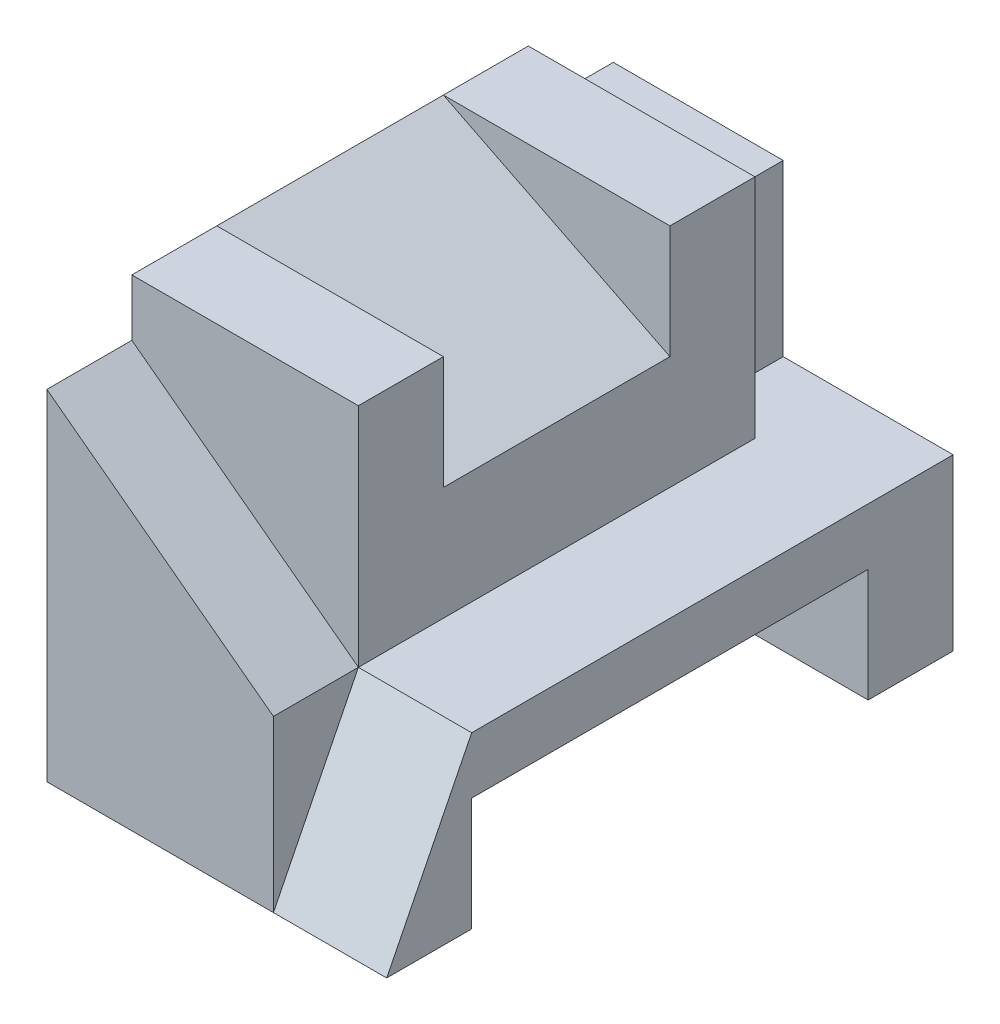
ISO-10303-21;
HEADER;
FILE_DESCRIPTION(('STEP AP214'),'2;1');
FILE_NAME('part.step','',(''),(''),'','','');
FILE_SCHEMA(('AUTOMOTIVE_DESIGN { 1 0 10303 214 1 1 1 1 }'));
ENDSEC;
DATA;
#1=APPLICATION_CONTEXT('core data for automotive mechanical design processes');
#2=APPLICATION_PROTOCOL_DEFINITION('international standard','automotive_design',2000,#1);
#3=PRODUCT_CONTEXT('',#1,'mechanical');
#4=PRODUCT('Part','Part','',(#3));
#5=PRODUCT_RELATED_PRODUCT_CATEGORY('part','',(#4));
#6=PRODUCT_DEFINITION_FORMATION('','',#4);
#7=PRODUCT_DEFINITION_CONTEXT('part definition',#1,'design');
#8=PRODUCT_DEFINITION('design','',#6,#7);
#9=PRODUCT_DEFINITION_SHAPE('','',#8);
#10=(LENGTH_UNIT() NAMED_UNIT(*) SI_UNIT(.MILLI.,.METRE.));
#11=(NAMED_UNIT(*) PLANE_ANGLE_UNIT() SI_UNIT($,.RADIAN.));
#12=(NAMED_UNIT(*) SI_UNIT($,.STERADIAN.) SOLID_ANGLE_UNIT());
#13=UNCERTAINTY_MEASURE_WITH_UNIT(LENGTH_MEASURE(1.E-05),#10,'distance_accuracy_value','');
#14=(GEOMETRIC_REPRESENTATION_CONTEXT(3) GLOBAL_UNCERTAINTY_ASSIGNED_CONTEXT((#13)) GLOBAL_UNIT_ASSIGNED_CONTEXT((#10,
#11,#12)) REPRESENTATION_CONTEXT('',''));
#15=CARTESIAN_POINT('',(0.,0.,0.));
#16=DIRECTION('',(0.,0.,1.));
#17=DIRECTION('',(1.,0.,0.));
#18=AXIS2_PLACEMENT_3D('',#15,#16,#17);
#19=CARTESIAN_POINT('',(6.,0.,-10.));
#20=DIRECTION('',(0.,-1.,0.));
#21=DIRECTION('',(0.,0.,-1.));
#22=AXIS2_PLACEMENT_3D('',#19,#20,#21);
#23=PLANE('',#22);
#24=DIRECTION('',(0.,0.,1.));
#25=VECTOR('',#24,1.);
#26=CARTESIAN_POINT('',(3.,0.,-10.));
#27=LINE('',#26,#25);
#28=CARTESIAN_POINT('',(3.,0.,-10.));
#29=VERTEX_POINT('',#28);
#30=CARTESIAN_POINT('',(3.,0.,-8.5));
#31=VERTEX_POINT('',#30);
#32=EDGE_CURVE('E202',#29,#31,#27,.T.);
#33=ORIENTED_EDGE('',*,*,#32,.T.);
#34=DIRECTION('',(1.,0.,0.));
#35=VECTOR('',#34,1.);
#36=CARTESIAN_POINT('',(0.,0.,-8.5));
#37=LINE('',#36,#35);
#38=CARTESIAN_POINT('',(4.,0.,-8.5));
#39=VERTEX_POINT('',#38);
#40=EDGE_CURVE('E63',#31,#39,#37,.T.);
#41=ORIENTED_EDGE('',*,*,#40,.T.);
#42=DIRECTION('',(0.,0.,-1.));
#43=VECTOR('',#42,1.);
#44=CARTESIAN_POINT('',(4.,0.,0.));
#45=LINE('',#44,#43);
#46=CARTESIAN_POINT('',(4.,0.,-1.5));
#47=VERTEX_POINT('',#46);
#48=EDGE_CURVE('E11',#47,#39,#45,.T.);
#49=ORIENTED_EDGE('',*,*,#48,.F.);
#50=DIRECTION('',(1.,0.,0.));
#51=VECTOR('',#50,1.);
#52=CARTESIAN_POINT('',(4.,0.,-1.5));
#53=LINE('',#52,#51);
#54=CARTESIAN_POINT('',(6.,0.,-1.5));
#55=VERTEX_POINT('',#54);
#56=EDGE_CURVE('E282',#47,#55,#53,.T.);
#57=ORIENTED_EDGE('',*,*,#56,.T.);
#58=DIRECTION('',(0.,0.,1.));
#59=VECTOR('',#58,1.);
#60=CARTESIAN_POINT('',(6.,0.,-10.));
#61=LINE('',#60,#59);
#62=CARTESIAN_POINT('',(6.,0.,-10.));
#63=VERTEX_POINT('',#62);
#64=EDGE_CURVE('E178',#63,#55,#61,.T.);
#65=ORIENTED_EDGE('',*,*,#64,.F.);
#66=DIRECTION('',(-1.,0.,0.));
#67=VECTOR('',#66,1.);
#68=CARTESIAN_POINT('',(6.,0.,-10.));
#69=LINE('',#68,#67);
#70=EDGE_CURVE('E310',#63,#29,#69,.T.);
#71=ORIENTED_EDGE('',*,*,#70,.T.);
#72=EDGE_LOOP('',(#33,#41,#49,#57,#65,#71));
#73=FACE_BOUND('',#72,.T.);
#74=ADVANCED_FACE('F39',(#73),#23,.F.);
#75=CARTESIAN_POINT('',(0.,4.,-8.5));
#76=DIRECTION('',(0.,0.,-1.));
#77=DIRECTION('',(-1.,0.,0.));
#78=AXIS2_PLACEMENT_3D('',#75,#76,#77);
#79=PLANE('',#78);
#80=DIRECTION('',(0.,-1.,0.));
#81=VECTOR('',#80,1.);
#82=CARTESIAN_POINT('',(3.,3.,-8.5));
#83=LINE('',#82,#81);
#84=CARTESIAN_POINT('',(3.,3.,-8.5));
#85=VERTEX_POINT('',#84);
#86=EDGE_CURVE('E187',#85,#31,#83,.T.);
#87=ORIENTED_EDGE('',*,*,#86,.F.);
#88=DIRECTION('',(1.,0.,0.));
#89=VECTOR('',#88,1.);
#90=CARTESIAN_POINT('',(0.,3.,-8.5));
#91=LINE('',#90,#89);
#92=CARTESIAN_POINT('',(0.,3.,-8.5));
#93=VERTEX_POINT('',#92);
#94=EDGE_CURVE('E402',#93,#85,#91,.T.);
#95=ORIENTED_EDGE('',*,*,#94,.F.);
#96=DIRECTION('',(0.,1.,0.));
#97=VECTOR('',#96,1.);
#98=CARTESIAN_POINT('',(0.,4.,-8.5));
#99=LINE('',#98,#97);
#100=CARTESIAN_POINT('',(0.,4.,-8.5));
#101=VERTEX_POINT('',#100);
#102=EDGE_CURVE('E193',#93,#101,#99,.T.);
#103=ORIENTED_EDGE('',*,*,#102,.T.);
#104=DIRECTION('',(1.,0.,0.));
#105=VECTOR('',#104,1.);
#106=CARTESIAN_POINT('',(0.,4.,-8.5));
#107=LINE('',#106,#105);
#108=CARTESIAN_POINT('',(4.,4.,-8.5));
#109=VERTEX_POINT('',#108);
#110=EDGE_CURVE('E218',#101,#109,#107,.T.);
#111=ORIENTED_EDGE('',*,*,#110,.T.);
#112=DIRECTION('',(0.,1.,0.));
#113=VECTOR('',#112,1.);
#114=CARTESIAN_POINT('',(4.,4.,-8.5));
#115=LINE('',#114,#113);
#116=EDGE_CURVE('E212',#39,#109,#115,.T.);
#117=ORIENTED_EDGE('',*,*,#116,.F.);
#118=ORIENTED_EDGE('',*,*,#40,.F.);
#119=EDGE_LOOP('',(#87,#95,#103,#111,#117,#118));
#120=FACE_BOUND('',#119,.T.);
#121=ADVANCED_FACE('F405',(#120),#79,.T.);
#122=CARTESIAN_POINT('',(-1.,0.,-3.));
#123=DIRECTION('',(0.,0.,1.));
#124=DIRECTION('',(0.,-1.,0.));
#125=AXIS2_PLACEMENT_3D('',#122,#123,#124);
#126=PLANE('',#125);
#127=DIRECTION('',(-0.894427190999916,0.447213595499958,0.));
#128=VECTOR('',#127,1.);
#129=CARTESIAN_POINT('',(0.,4.,-3.));
#130=LINE('',#129,#128);
#131=CARTESIAN_POINT('',(4.,2.,-3.));
#132=VERTEX_POINT('',#131);
#133=CARTESIAN_POINT('',(0.,4.,-3.));
#134=VERTEX_POINT('',#133);
#135=EDGE_CURVE('E200',#132,#134,#130,.T.);
#136=ORIENTED_EDGE('',*,*,#135,.T.);
#137=DIRECTION('',(1.,0.,0.));
#138=VECTOR('',#137,1.);
#139=CARTESIAN_POINT('',(-1.,4.,-3.));
#140=LINE('',#139,#138);
#141=CARTESIAN_POINT('',(4.,4.,-3.));
#142=VERTEX_POINT('',#141);
#143=EDGE_CURVE('E235',#134,#142,#140,.T.);
#144=ORIENTED_EDGE('',*,*,#143,.T.);
#145=DIRECTION('',(0.,-1.,0.));
#146=VECTOR('',#145,1.);
#147=CARTESIAN_POINT('',(4.,0.,-3.));
#148=LINE('',#147,#146);
#149=EDGE_CURVE('E231',#142,#132,#148,.T.);
#150=ORIENTED_EDGE('',*,*,#149,.T.);
#151=EDGE_LOOP('',(#136,#144,#150));
#152=FACE_BOUND('',#151,.T.);
#153=ADVANCED_FACE('F435',(#152),#126,.F.);
#154=CARTESIAN_POINT('',(-1.,0.,-7.));
#155=DIRECTION('',(0.,0.,-1.));
#156=DIRECTION('',(0.,1.,0.));
#157=AXIS2_PLACEMENT_3D('',#154,#155,#156);
#158=PLANE('',#157);
#159=DIRECTION('',(-0.894427190999916,0.447213595499958,0.));
#160=VECTOR('',#159,1.);
#161=CARTESIAN_POINT('',(0.,4.,-7.));
#162=LINE('',#161,#160);
#163=CARTESIAN_POINT('',(4.,2.,-7.));
#164=VERTEX_POINT('',#163);
#165=CARTESIAN_POINT('',(0.,4.,-7.));
#166=VERTEX_POINT('',#165);
#167=EDGE_CURVE('E195',#164,#166,#162,.T.);
#168=ORIENTED_EDGE('',*,*,#167,.F.);
#169=DIRECTION('',(0.,1.,0.));
#170=VECTOR('',#169,1.);
#171=CARTESIAN_POINT('',(4.,0.,-7.));
#172=LINE('',#171,#170);
#173=CARTESIAN_POINT('',(4.,4.,-7.));
#174=VERTEX_POINT('',#173);
#175=EDGE_CURVE('E228',#164,#174,#172,.T.);
#176=ORIENTED_EDGE('',*,*,#175,.T.);
#177=DIRECTION('',(1.,0.,0.));
#178=VECTOR('',#177,1.);
#179=CARTESIAN_POINT('',(-1.,4.,-7.));
#180=LINE('',#179,#178);
#181=EDGE_CURVE('E234',#166,#174,#180,.T.);
#182=ORIENTED_EDGE('',*,*,#181,.F.);
#183=EDGE_LOOP('',(#168,#176,#182));
#184=FACE_BOUND('',#183,.T.);
#185=ADVANCED_FACE('F429',(#184),#158,.F.);
#186=CARTESIAN_POINT('',(0.,4.,0.));
#187=DIRECTION('',(0.,1.,0.));
#188=DIRECTION('',(0.,0.,1.));
#189=AXIS2_PLACEMENT_3D('',#186,#187,#188);
#190=PLANE('',#189);
#191=ORIENTED_EDGE('',*,*,#143,.F.);
#192=DIRECTION('',(0.,0.,1.));
#193=VECTOR('',#192,1.);
#194=CARTESIAN_POINT('',(0.,4.,-8.));
#195=LINE('',#194,#193);
#196=CARTESIAN_POINT('',(0.,4.,-1.5));
#197=VERTEX_POINT('',#196);
#198=EDGE_CURVE('E270',#134,#197,#195,.T.);
#199=ORIENTED_EDGE('',*,*,#198,.T.);
#200=DIRECTION('',(-1.,0.,0.));
#201=VECTOR('',#200,1.);
#202=CARTESIAN_POINT('',(0.,4.,-1.5));
#203=LINE('',#202,#201);
#204=CARTESIAN_POINT('',(4.,4.,-1.5));
#205=VERTEX_POINT('',#204);
#206=EDGE_CURVE('E245',#205,#197,#203,.T.);
#207=ORIENTED_EDGE('',*,*,#206,.F.);
#208=DIRECTION('',(0.,0.,-1.));
#209=VECTOR('',#208,1.);
#210=CARTESIAN_POINT('',(4.,4.,0.));
#211=LINE('',#210,#209);
#212=EDGE_CURVE('E266',#205,#142,#211,.T.);
#213=ORIENTED_EDGE('',*,*,#212,.T.);
#214=EDGE_LOOP('',(#191,#199,#207,#213));
#215=FACE_BOUND('',#214,.T.);
#216=ADVANCED_FACE('F421',(#215),#190,.T.);
#217=CARTESIAN_POINT('',(4.,0.,0.));
#218=DIRECTION('',(-1.,0.,0.));
#219=DIRECTION('',(0.,0.,1.));
#220=AXIS2_PLACEMENT_3D('',#217,#218,#219);
#221=PLANE('',#220);
#222=ORIENTED_EDGE('',*,*,#48,.T.);
#223=ORIENTED_EDGE('',*,*,#116,.T.);
#224=EDGE_CURVE('E263',#174,#109,#211,.T.);
#225=ORIENTED_EDGE('',*,*,#224,.F.);
#226=ORIENTED_EDGE('',*,*,#175,.F.);
#227=DIRECTION('',(0.,0.,-1.));
#228=VECTOR('',#227,1.);
#229=CARTESIAN_POINT('',(4.,2.,0.));
#230=LINE('',#229,#228);
#231=EDGE_CURVE('E222',#132,#164,#230,.T.);
#232=ORIENTED_EDGE('',*,*,#231,.F.);
#233=ORIENTED_EDGE('',*,*,#149,.F.);
#234=ORIENTED_EDGE('',*,*,#212,.F.);
#235=DIRECTION('',(0.,1.,0.));
#236=VECTOR('',#235,1.);
#237=CARTESIAN_POINT('',(4.,4.,-1.5));
#238=LINE('',#237,#236);
#239=EDGE_CURVE('E242',#47,#205,#238,.T.);
#240=ORIENTED_EDGE('',*,*,#239,.F.);
#241=EDGE_LOOP('',(#222,#223,#225,#226,#232,#233,#234,#240));
#242=FACE_BOUND('',#241,.T.);
#243=ADVANCED_FACE('F410',(#242),#221,.F.);
#244=ORIENTED_EDGE('',*,*,#181,.T.);
#245=ORIENTED_EDGE('',*,*,#224,.T.);
#246=ORIENTED_EDGE('',*,*,#110,.F.);
#247=EDGE_CURVE('E271',#101,#166,#195,.T.);
#248=ORIENTED_EDGE('',*,*,#247,.T.);
#249=EDGE_LOOP('',(#244,#245,#246,#248));
#250=FACE_BOUND('',#249,.T.);
#251=ADVANCED_FACE('F426',(#250),#190,.T.);
#252=CARTESIAN_POINT('',(6.,0.,0.));
#253=DIRECTION('',(0.,0.,-1.));
#254=DIRECTION('',(0.,1.,0.));
#255=AXIS2_PLACEMENT_3D('',#252,#253,#254);
#256=PLANE('',#255);
#257=DIRECTION('',(0.,-1.,0.));
#258=VECTOR('',#257,1.);
#259=CARTESIAN_POINT('',(4.,0.,0.));
#260=LINE('',#259,#258);
#261=CARTESIAN_POINT('',(4.,0.,0.));
#262=VERTEX_POINT('',#261);
#263=CARTESIAN_POINT('',(4.,-3.,0.));
#264=VERTEX_POINT('',#263);
#265=EDGE_CURVE('E275',#262,#264,#260,.T.);
#266=ORIENTED_EDGE('',*,*,#265,.F.);
#267=DIRECTION('',(0.8,-0.6,0.));
#268=VECTOR('',#267,1.);
#269=CARTESIAN_POINT('',(0.,3.,0.));
#270=LINE('',#269,#268);
#271=CARTESIAN_POINT('',(0.,3.,0.));
#272=VERTEX_POINT('',#271);
#273=EDGE_CURVE('E238',#272,#262,#270,.T.);
#274=ORIENTED_EDGE('',*,*,#273,.F.);
#275=DIRECTION('',(0.,-1.,0.));
#276=VECTOR('',#275,1.);
#277=CARTESIAN_POINT('',(0.,0.,0.));
#278=LINE('',#277,#276);
#279=CARTESIAN_POINT('',(0.,-3.,0.));
#280=VERTEX_POINT('',#279);
#281=EDGE_CURVE('E288',#272,#280,#278,.T.);
#282=ORIENTED_EDGE('',*,*,#281,.T.);
#283=DIRECTION('',(-1.,0.,0.));
#284=VECTOR('',#283,1.);
#285=CARTESIAN_POINT('',(6.,-3.,0.));
#286=LINE('',#285,#284);
#287=EDGE_CURVE('E346',#264,#280,#286,.T.);
#288=ORIENTED_EDGE('',*,*,#287,.F.);
#289=EDGE_LOOP('',(#266,#274,#282,#288));
#290=FACE_BOUND('',#289,.T.);
#291=ADVANCED_FACE('F374',(#290),#256,.F.);
#292=CARTESIAN_POINT('',(6.,-3.,0.));
#293=DIRECTION('',(0.,1.,0.));
#294=DIRECTION('',(0.,0.,1.));
#295=AXIS2_PLACEMENT_3D('',#292,#293,#294);
#296=PLANE('',#295);
#297=DIRECTION('',(0.,0.,-1.));
#298=VECTOR('',#297,1.);
#299=CARTESIAN_POINT('',(0.,-3.,0.));
#300=LINE('',#299,#298);
#301=CARTESIAN_POINT('',(0.,-3.,-1.5));
#302=VERTEX_POINT('',#301);
#303=EDGE_CURVE('E313',#280,#302,#300,.T.);
#304=ORIENTED_EDGE('',*,*,#303,.T.);
#305=DIRECTION('',(-1.,0.,0.));
#306=VECTOR('',#305,1.);
#307=CARTESIAN_POINT('',(6.,-3.,-1.5));
#308=LINE('',#307,#306);
#309=CARTESIAN_POINT('',(6.,-3.,-1.5));
#310=VERTEX_POINT('',#309);
#311=EDGE_CURVE('E343',#310,#302,#308,.T.);
#312=ORIENTED_EDGE('',*,*,#311,.F.);
#313=DIRECTION('',(0.,0.,-1.));
#314=VECTOR('',#313,1.);
#315=CARTESIAN_POINT('',(6.,-3.,0.));
#316=LINE('',#315,#314);
#317=CARTESIAN_POINT('',(6.,-3.,0.));
#318=VERTEX_POINT('',#317);
#319=EDGE_CURVE('E292',#318,#310,#316,.T.);
#320=ORIENTED_EDGE('',*,*,#319,.F.);
#321=EDGE_CURVE('E42',#318,#264,#286,.T.);
#322=ORIENTED_EDGE('',*,*,#321,.T.);
#323=ORIENTED_EDGE('',*,*,#287,.T.);
#324=EDGE_LOOP('',(#304,#312,#320,#322,#323));
#325=FACE_BOUND('',#324,.T.);
#326=ADVANCED_FACE('F359',(#325),#296,.F.);
#327=CARTESIAN_POINT('',(6.,-3.,-1.5));
#328=DIRECTION('',(0.,0.,1.));
#329=DIRECTION('',(1.,0.,0.));
#330=AXIS2_PLACEMENT_3D('',#327,#328,#329);
#331=PLANE('',#330);
#332=DIRECTION('',(0.,1.,0.));
#333=VECTOR('',#332,1.);
#334=CARTESIAN_POINT('',(0.,-3.,-1.5));
#335=LINE('',#334,#333);
#336=CARTESIAN_POINT('',(0.,-1.,-1.5));
#337=VERTEX_POINT('',#336);
#338=EDGE_CURVE('E316',#302,#337,#335,.T.);
#339=ORIENTED_EDGE('',*,*,#338,.T.);
#340=DIRECTION('',(-1.,0.,0.));
#341=VECTOR('',#340,1.);
#342=CARTESIAN_POINT('',(6.,-1.,-1.5));
#343=LINE('',#342,#341);
#344=CARTESIAN_POINT('',(6.,-1.,-1.5));
#345=VERTEX_POINT('',#344);
#346=EDGE_CURVE('E340',#345,#337,#343,.T.);
#347=ORIENTED_EDGE('',*,*,#346,.F.);
#348=DIRECTION('',(0.,1.,0.));
#349=VECTOR('',#348,1.);
#350=CARTESIAN_POINT('',(6.,-3.,-1.5));
#351=LINE('',#350,#349);
#352=EDGE_CURVE('E295',#310,#345,#351,.T.);
#353=ORIENTED_EDGE('',*,*,#352,.F.);
#354=ORIENTED_EDGE('',*,*,#311,.T.);
#355=EDGE_LOOP('',(#339,#347,#353,#354));
#356=FACE_BOUND('',#355,.T.);
#357=ADVANCED_FACE('F380',(#356),#331,.F.);
#358=CARTESIAN_POINT('',(6.,-1.,-1.5));
#359=DIRECTION('',(0.,1.,0.));
#360=DIRECTION('',(0.,0.,1.));
#361=AXIS2_PLACEMENT_3D('',#358,#359,#360);
#362=PLANE('',#361);
#363=DIRECTION('',(0.,0.,-1.));
#364=VECTOR('',#363,1.);
#365=CARTESIAN_POINT('',(0.,-1.,-1.5));
#366=LINE('',#365,#364);
#367=CARTESIAN_POINT('',(0.,-1.,-8.5));
#368=VERTEX_POINT('',#367);
#369=EDGE_CURVE('E319',#337,#368,#366,.T.);
#370=ORIENTED_EDGE('',*,*,#369,.T.);
#371=DIRECTION('',(-1.,0.,0.));
#372=VECTOR('',#371,1.);
#373=CARTESIAN_POINT('',(6.,-1.,-8.5));
#374=LINE('',#373,#372);
#375=CARTESIAN_POINT('',(6.,-1.,-8.5));
#376=VERTEX_POINT('',#375);
#377=EDGE_CURVE('E336',#376,#368,#374,.T.);
#378=ORIENTED_EDGE('',*,*,#377,.F.);
#379=DIRECTION('',(0.,0.,-1.));
#380=VECTOR('',#379,1.);
#381=CARTESIAN_POINT('',(6.,-1.,-1.5));
#382=LINE('',#381,#380);
#383=EDGE_CURVE('E298',#345,#376,#382,.T.);
#384=ORIENTED_EDGE('',*,*,#383,.F.);
#385=ORIENTED_EDGE('',*,*,#346,.T.);
#386=EDGE_LOOP('',(#370,#378,#384,#385));
#387=FACE_BOUND('',#386,.T.);
#388=ADVANCED_FACE('F386',(#387),#362,.F.);
#389=CARTESIAN_POINT('',(6.,-1.,-8.5));
#390=DIRECTION('',(0.,0.,-1.));
#391=DIRECTION('',(-1.,0.,0.));
#392=AXIS2_PLACEMENT_3D('',#389,#390,#391);
#393=PLANE('',#392);
#394=DIRECTION('',(0.,-1.,0.));
#395=VECTOR('',#394,1.);
#396=CARTESIAN_POINT('',(0.,-1.,-8.5));
#397=LINE('',#396,#395);
#398=CARTESIAN_POINT('',(0.,-3.,-8.5));
#399=VERTEX_POINT('',#398);
#400=EDGE_CURVE('E322',#368,#399,#397,.T.);
#401=ORIENTED_EDGE('',*,*,#400,.T.);
#402=DIRECTION('',(-1.,0.,0.));
#403=VECTOR('',#402,1.);
#404=CARTESIAN_POINT('',(6.,-3.,-8.5));
#405=LINE('',#404,#403);
#406=CARTESIAN_POINT('',(6.,-3.,-8.5));
#407=VERTEX_POINT('',#406);
#408=EDGE_CURVE('E332',#407,#399,#405,.T.);
#409=ORIENTED_EDGE('',*,*,#408,.F.);
#410=DIRECTION('',(0.,-1.,0.));
#411=VECTOR('',#410,1.);
#412=CARTESIAN_POINT('',(6.,-1.,-8.5));
#413=LINE('',#412,#411);
#414=EDGE_CURVE('E301',#376,#407,#413,.T.);
#415=ORIENTED_EDGE('',*,*,#414,.F.);
#416=ORIENTED_EDGE('',*,*,#377,.T.);
#417=EDGE_LOOP('',(#401,#409,#415,#416));
#418=FACE_BOUND('',#417,.T.);
#419=ADVANCED_FACE('F389',(#418),#393,.F.);
#420=CARTESIAN_POINT('',(6.,-3.,-8.5));
#421=DIRECTION('',(0.,1.,0.));
#422=DIRECTION('',(0.,0.,1.));
#423=AXIS2_PLACEMENT_3D('',#420,#421,#422);
#424=PLANE('',#423);
#425=DIRECTION('',(0.,0.,-1.));
#426=VECTOR('',#425,1.);
#427=CARTESIAN_POINT('',(0.,-3.,-8.5));
#428=LINE('',#427,#426);
#429=CARTESIAN_POINT('',(0.,-3.,-10.));
#430=VERTEX_POINT('',#429);
#431=EDGE_CURVE('E179',#399,#430,#428,.T.);
#432=ORIENTED_EDGE('',*,*,#431,.T.);
#433=DIRECTION('',(-1.,0.,0.));
#434=VECTOR('',#433,1.);
#435=CARTESIAN_POINT('',(6.,-3.,-10.));
#436=LINE('',#435,#434);
#437=CARTESIAN_POINT('',(6.,-3.,-10.));
#438=VERTEX_POINT('',#437);
#439=EDGE_CURVE('E173',#438,#430,#436,.T.);
#440=ORIENTED_EDGE('',*,*,#439,.F.);
#441=DIRECTION('',(0.,0.,-1.));
#442=VECTOR('',#441,1.);
#443=CARTESIAN_POINT('',(6.,-3.,-8.5));
#444=LINE('',#443,#442);
#445=EDGE_CURVE('E304',#407,#438,#444,.T.);
#446=ORIENTED_EDGE('',*,*,#445,.F.);
#447=ORIENTED_EDGE('',*,*,#408,.T.);
#448=EDGE_LOOP('',(#432,#440,#446,#447));
#449=FACE_BOUND('',#448,.T.);
#450=ADVANCED_FACE('F392',(#449),#424,.F.);
#451=CARTESIAN_POINT('',(6.,-3.,-10.));
#452=DIRECTION('',(0.,0.,1.));
#453=DIRECTION('',(1.,0.,0.));
#454=AXIS2_PLACEMENT_3D('',#451,#452,#453);
#455=PLANE('',#454);
#456=DIRECTION('',(0.,1.,0.));
#457=VECTOR('',#456,1.);
#458=CARTESIAN_POINT('',(0.,-3.,-10.));
#459=LINE('',#458,#457);
#460=CARTESIAN_POINT('',(0.,3.,-10.));
#461=VERTEX_POINT('',#460);
#462=EDGE_CURVE('E167',#430,#461,#459,.T.);
#463=ORIENTED_EDGE('',*,*,#462,.T.);
#464=DIRECTION('',(1.,0.,0.));
#465=VECTOR('',#464,1.);
#466=CARTESIAN_POINT('',(0.,3.,-10.));
#467=LINE('',#466,#465);
#468=CARTESIAN_POINT('',(3.,3.,-10.));
#469=VERTEX_POINT('',#468);
#470=EDGE_CURVE('E170',#461,#469,#467,.T.);
#471=ORIENTED_EDGE('',*,*,#470,.T.);
#472=DIRECTION('',(0.,-1.,0.));
#473=VECTOR('',#472,1.);
#474=CARTESIAN_POINT('',(3.,3.,-10.));
#475=LINE('',#474,#473);
#476=EDGE_CURVE('E186',#469,#29,#475,.T.);
#477=ORIENTED_EDGE('',*,*,#476,.T.);
#478=ORIENTED_EDGE('',*,*,#70,.F.);
#479=DIRECTION('',(0.,1.,0.));
#480=VECTOR('',#479,1.);
#481=CARTESIAN_POINT('',(6.,-3.,-10.));
#482=LINE('',#481,#480);
#483=EDGE_CURVE('E307',#438,#63,#482,.T.);
#484=ORIENTED_EDGE('',*,*,#483,.F.);
#485=ORIENTED_EDGE('',*,*,#439,.T.);
#486=EDGE_LOOP('',(#463,#471,#477,#478,#484,#485));
#487=FACE_BOUND('',#486,.T.);
#488=ADVANCED_FACE('F169',(#487),#455,.F.);
#489=CARTESIAN_POINT('',(6.,0.,0.));
#490=DIRECTION('',(1.,0.,0.));
#491=DIRECTION('',(0.,0.,-1.));
#492=AXIS2_PLACEMENT_3D('',#489,#490,#491);
#493=PLANE('',#492);
#494=DIRECTION('',(0.,0.894427190999916,-0.447213595499958));
#495=VECTOR('',#494,1.);
#496=CARTESIAN_POINT('',(6.,-3.,0.));
#497=LINE('',#496,#495);
#498=EDGE_CURVE('E273',#318,#55,#497,.T.);
#499=ORIENTED_EDGE('',*,*,#498,.F.);
#500=ORIENTED_EDGE('',*,*,#319,.T.);
#501=ORIENTED_EDGE('',*,*,#352,.T.);
#502=ORIENTED_EDGE('',*,*,#383,.T.);
#503=ORIENTED_EDGE('',*,*,#414,.T.);
#504=ORIENTED_EDGE('',*,*,#445,.T.);
#505=ORIENTED_EDGE('',*,*,#483,.T.);
#506=ORIENTED_EDGE('',*,*,#64,.T.);
#507=EDGE_LOOP('',(#499,#500,#501,#502,#503,#504,#505,#506));
#508=FACE_BOUND('',#507,.T.);
#509=ADVANCED_FACE('F366',(#508),#493,.T.);
#510=CARTESIAN_POINT('',(0.,0.,0.));
#511=DIRECTION('',(1.,0.,0.));
#512=DIRECTION('',(0.,0.,-1.));
#513=AXIS2_PLACEMENT_3D('',#510,#511,#512);
#514=PLANE('',#513);
#515=ORIENTED_EDGE('',*,*,#198,.F.);
#516=DIRECTION('',(0.,0.,-1.));
#517=VECTOR('',#516,1.);
#518=CARTESIAN_POINT('',(0.,4.,-3.));
#519=LINE('',#518,#517);
#520=EDGE_CURVE('E207',#134,#166,#519,.T.);
#521=ORIENTED_EDGE('',*,*,#520,.T.);
#522=ORIENTED_EDGE('',*,*,#247,.F.);
#523=ORIENTED_EDGE('',*,*,#102,.F.);
#524=DIRECTION('',(0.,0.,1.));
#525=VECTOR('',#524,1.);
#526=CARTESIAN_POINT('',(0.,3.,-10.));
#527=LINE('',#526,#525);
#528=EDGE_CURVE('E183',#461,#93,#527,.T.);
#529=ORIENTED_EDGE('',*,*,#528,.F.);
#530=ORIENTED_EDGE('',*,*,#462,.F.);
#531=ORIENTED_EDGE('',*,*,#431,.F.);
#532=ORIENTED_EDGE('',*,*,#400,.F.);
#533=ORIENTED_EDGE('',*,*,#369,.F.);
#534=ORIENTED_EDGE('',*,*,#338,.F.);
#535=ORIENTED_EDGE('',*,*,#303,.F.);
#536=ORIENTED_EDGE('',*,*,#281,.F.);
#537=DIRECTION('',(0.,0.,1.));
#538=VECTOR('',#537,1.);
#539=CARTESIAN_POINT('',(0.,3.,-1.5));
#540=LINE('',#539,#538);
#541=CARTESIAN_POINT('',(0.,3.,-1.5));
#542=VERTEX_POINT('',#541);
#543=EDGE_CURVE('E256',#542,#272,#540,.T.);
#544=ORIENTED_EDGE('',*,*,#543,.F.);
#545=DIRECTION('',(0.,-1.,0.));
#546=VECTOR('',#545,1.);
#547=CARTESIAN_POINT('',(0.,3.,-1.5));
#548=LINE('',#547,#546);
#549=EDGE_CURVE('E249',#197,#542,#548,.T.);
#550=ORIENTED_EDGE('',*,*,#549,.F.);
#551=EDGE_LOOP('',(#515,#521,#522,#523,#529,#530,#531,#532,#533,#534,#535,#536,#544,#550));
#552=FACE_BOUND('',#551,.T.);
#553=ADVANCED_FACE('F191',(#552),#514,.F.);
#554=CARTESIAN_POINT('',(4.,-3.,0.));
#555=DIRECTION('',(0.,-0.447213595499958,-0.894427190999916));
#556=DIRECTION('',(0.,0.894427190999916,-0.447213595499958));
#557=AXIS2_PLACEMENT_3D('',#554,#555,#556);
#558=PLANE('',#557);
#559=ORIENTED_EDGE('',*,*,#498,.T.);
#560=ORIENTED_EDGE('',*,*,#56,.F.);
#561=DIRECTION('',(0.,0.894427190999916,-0.447213595499958));
#562=VECTOR('',#561,1.);
#563=CARTESIAN_POINT('',(4.,-3.,0.));
#564=LINE('',#563,#562);
#565=EDGE_CURVE('E278',#264,#47,#564,.T.);
#566=ORIENTED_EDGE('',*,*,#565,.F.);
#567=ORIENTED_EDGE('',*,*,#321,.F.);
#568=EDGE_LOOP('',(#559,#560,#566,#567));
#569=FACE_BOUND('',#568,.T.);
#570=ADVANCED_FACE('F363',(#569),#558,.F.);
#571=ORIENTED_EDGE('',*,*,#565,.T.);
#572=DIRECTION('',(0.,0.,1.));
#573=VECTOR('',#572,1.);
#574=CARTESIAN_POINT('',(4.,0.,-1.5));
#575=LINE('',#574,#573);
#576=EDGE_CURVE('E259',#47,#262,#575,.T.);
#577=ORIENTED_EDGE('',*,*,#576,.T.);
#578=ORIENTED_EDGE('',*,*,#265,.T.);
#579=EDGE_LOOP('',(#571,#577,#578));
#580=FACE_BOUND('',#579,.T.);
#581=ADVANCED_FACE('F370',(#580),#221,.F.);
#582=CARTESIAN_POINT('',(0.,3.,-1.5));
#583=DIRECTION('',(-0.6,-0.8,0.));
#584=DIRECTION('',(0.8,-0.6,0.));
#585=AXIS2_PLACEMENT_3D('',#582,#583,#584);
#586=PLANE('',#585);
#587=ORIENTED_EDGE('',*,*,#273,.T.);
#588=ORIENTED_EDGE('',*,*,#576,.F.);
#589=DIRECTION('',(0.8,-0.6,0.));
#590=VECTOR('',#589,1.);
#591=CARTESIAN_POINT('',(0.,3.,-1.5));
#592=LINE('',#591,#590);
#593=EDGE_CURVE('E252',#542,#47,#592,.T.);
#594=ORIENTED_EDGE('',*,*,#593,.F.);
#595=ORIENTED_EDGE('',*,*,#543,.T.);
#596=EDGE_LOOP('',(#587,#588,#594,#595));
#597=FACE_BOUND('',#596,.T.);
#598=ADVANCED_FACE('F498',(#597),#586,.F.);
#599=CARTESIAN_POINT('',(0.,0.,-1.5));
#600=DIRECTION('',(0.,0.,1.));
#601=DIRECTION('',(1.,0.,0.));
#602=AXIS2_PLACEMENT_3D('',#599,#600,#601);
#603=PLANE('',#602);
#604=ORIENTED_EDGE('',*,*,#239,.T.);
#605=ORIENTED_EDGE('',*,*,#206,.T.);
#606=ORIENTED_EDGE('',*,*,#549,.T.);
#607=ORIENTED_EDGE('',*,*,#593,.T.);
#608=EDGE_LOOP('',(#604,#605,#606,#607));
#609=FACE_BOUND('',#608,.T.);
#610=ADVANCED_FACE('F417',(#609),#603,.T.);
#611=CARTESIAN_POINT('',(0.,4.,-3.));
#612=DIRECTION('',(-0.447213595499958,-0.894427190999916,0.));
#613=DIRECTION('',(0.894427190999916,-0.447213595499958,0.));
#614=AXIS2_PLACEMENT_3D('',#611,#612,#613);
#615=PLANE('',#614);
#616=ORIENTED_EDGE('',*,*,#167,.T.);
#617=ORIENTED_EDGE('',*,*,#520,.F.);
#618=ORIENTED_EDGE('',*,*,#135,.F.);
#619=ORIENTED_EDGE('',*,*,#231,.T.);
#620=EDGE_LOOP('',(#616,#617,#618,#619));
#621=FACE_BOUND('',#620,.T.);
#622=ADVANCED_FACE('F431',(#621),#615,.F.);
#623=CARTESIAN_POINT('',(0.,3.,-10.));
#624=DIRECTION('',(0.,-1.,0.));
#625=DIRECTION('',(1.,0.,0.));
#626=AXIS2_PLACEMENT_3D('',#623,#624,#625);
#627=PLANE('',#626);
#628=ORIENTED_EDGE('',*,*,#94,.T.);
#629=DIRECTION('',(0.,0.,1.));
#630=VECTOR('',#629,1.);
#631=CARTESIAN_POINT('',(3.,3.,-10.));
#632=LINE('',#631,#630);
#633=EDGE_CURVE('E55',#469,#85,#632,.T.);
#634=ORIENTED_EDGE('',*,*,#633,.F.);
#635=ORIENTED_EDGE('',*,*,#470,.F.);
#636=ORIENTED_EDGE('',*,*,#528,.T.);
#637=EDGE_LOOP('',(#628,#634,#635,#636));
#638=FACE_BOUND('',#637,.T.);
#639=ADVANCED_FACE('F182',(#638),#627,.F.);
#640=CARTESIAN_POINT('',(3.,3.,-10.));
#641=DIRECTION('',(-1.,0.,0.));
#642=DIRECTION('',(0.,-1.,0.));
#643=AXIS2_PLACEMENT_3D('',#640,#641,#642);
#644=PLANE('',#643);
#645=ORIENTED_EDGE('',*,*,#86,.T.);
#646=ORIENTED_EDGE('',*,*,#32,.F.);
#647=ORIENTED_EDGE('',*,*,#476,.F.);
#648=ORIENTED_EDGE('',*,*,#633,.T.);
#649=EDGE_LOOP('',(#645,#646,#647,#648));
#650=FACE_BOUND('',#649,.T.);
#651=ADVANCED_FACE('F396',(#650),#644,.F.);
#652=CLOSED_SHELL('',(#74,#121,#153,#185,#216,#243,#251,#291,#326,#357,#388,#419,#450,#488,#509,
#553,#570,#581,#598,#610,#622,#639,#651));
#653=MANIFOLD_SOLID_BREP('B2',#652);
#654=ADVANCED_BREP_SHAPE_REPRESENTATION('',(#18,#653),#14);
#655=SHAPE_DEFINITION_REPRESENTATION(#9,#654);
ENDSEC;
END-ISO-10303-21;
